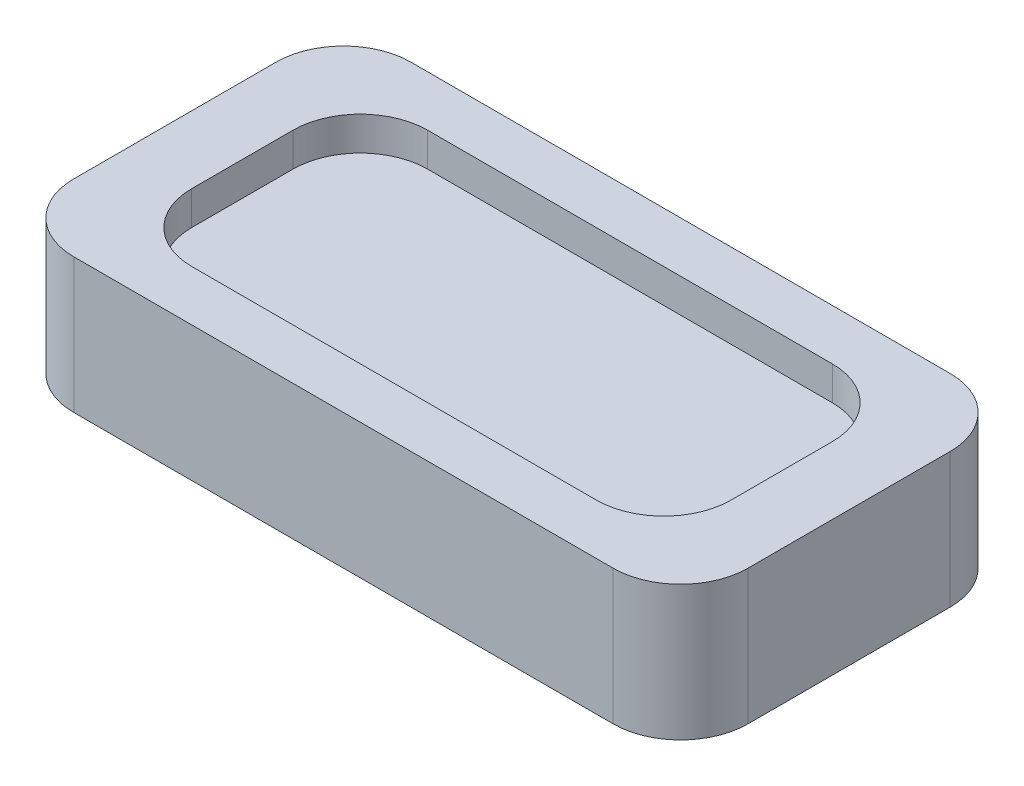
ISO-10303-21;
HEADER;
FILE_DESCRIPTION(('STEP AP214'),'2;1');
FILE_NAME('part.step','',(''),(''),'','','');
FILE_SCHEMA(('AUTOMOTIVE_DESIGN { 1 0 10303 214 1 1 1 1 }'));
ENDSEC;
DATA;
#1=APPLICATION_CONTEXT('core data for automotive mechanical design processes');
#2=APPLICATION_PROTOCOL_DEFINITION('international standard','automotive_design',2000,#1);
#3=PRODUCT_CONTEXT('',#1,'mechanical');
#4=PRODUCT('Part','Part','',(#3));
#5=PRODUCT_RELATED_PRODUCT_CATEGORY('part','',(#4));
#6=PRODUCT_DEFINITION_FORMATION('','',#4);
#7=PRODUCT_DEFINITION_CONTEXT('part definition',#1,'design');
#8=PRODUCT_DEFINITION('design','',#6,#7);
#9=PRODUCT_DEFINITION_SHAPE('','',#8);
#10=(LENGTH_UNIT() NAMED_UNIT(*) SI_UNIT(.MILLI.,.METRE.));
#11=(NAMED_UNIT(*) PLANE_ANGLE_UNIT() SI_UNIT($,.RADIAN.));
#12=(NAMED_UNIT(*) SI_UNIT($,.STERADIAN.) SOLID_ANGLE_UNIT());
#13=UNCERTAINTY_MEASURE_WITH_UNIT(LENGTH_MEASURE(1.E-05),#10,'distance_accuracy_value','');
#14=(GEOMETRIC_REPRESENTATION_CONTEXT(3) GLOBAL_UNCERTAINTY_ASSIGNED_CONTEXT((#13)) GLOBAL_UNIT_ASSIGNED_CONTEXT((#10,
#11,#12)) REPRESENTATION_CONTEXT('',''));
#15=CARTESIAN_POINT('',(0.,0.,0.));
#16=DIRECTION('',(0.,0.,1.));
#17=DIRECTION('',(1.,0.,0.));
#18=AXIS2_PLACEMENT_3D('',#15,#16,#17);
#19=CARTESIAN_POINT('',(-50.,20.,-25.));
#20=DIRECTION('',(1.,0.,0.));
#21=DIRECTION('',(0.,0.,-1.));
#22=AXIS2_PLACEMENT_3D('',#19,#20,#21);
#23=PLANE('',#22);
#24=DIRECTION('',(0.,0.,1.));
#25=VECTOR('',#24,1.);
#26=CARTESIAN_POINT('',(-50.,20.,-25.));
#27=LINE('',#26,#25);
#28=CARTESIAN_POINT('',(-50.,20.,-15.));
#29=VERTEX_POINT('',#28);
#30=CARTESIAN_POINT('',(-50.,20.,15.));
#31=VERTEX_POINT('',#30);
#32=EDGE_CURVE('E176',#29,#31,#27,.T.);
#33=ORIENTED_EDGE('',*,*,#32,.F.);
#34=DIRECTION('',(0.,-1.,0.));
#35=VECTOR('',#34,1.);
#36=CARTESIAN_POINT('',(-50.,0.,-15.));
#37=LINE('',#36,#35);
#38=CARTESIAN_POINT('',(-50.,0.,-15.));
#39=VERTEX_POINT('',#38);
#40=EDGE_CURVE('E160',#29,#39,#37,.T.);
#41=ORIENTED_EDGE('',*,*,#40,.T.);
#42=DIRECTION('',(0.,0.,1.));
#43=VECTOR('',#42,1.);
#44=CARTESIAN_POINT('',(-50.,0.,-25.));
#45=LINE('',#44,#43);
#46=CARTESIAN_POINT('',(-50.,0.,15.));
#47=VERTEX_POINT('',#46);
#48=EDGE_CURVE('E173',#39,#47,#45,.T.);
#49=ORIENTED_EDGE('',*,*,#48,.T.);
#50=DIRECTION('',(0.,-1.,0.));
#51=VECTOR('',#50,1.);
#52=CARTESIAN_POINT('',(-50.,20.,15.));
#53=LINE('',#52,#51);
#54=EDGE_CURVE('E179',#47,#31,#53,.F.);
#55=ORIENTED_EDGE('',*,*,#54,.T.);
#56=EDGE_LOOP('',(#33,#41,#49,#55));
#57=FACE_BOUND('',#56,.T.);
#58=ADVANCED_FACE('F43',(#57),#23,.F.);
#59=CARTESIAN_POINT('',(-50.,20.,25.));
#60=DIRECTION('',(0.,0.,-1.));
#61=DIRECTION('',(-1.,0.,0.));
#62=AXIS2_PLACEMENT_3D('',#59,#60,#61);
#63=PLANE('',#62);
#64=DIRECTION('',(1.,0.,0.));
#65=VECTOR('',#64,1.);
#66=CARTESIAN_POINT('',(-50.,20.,25.));
#67=LINE('',#66,#65);
#68=CARTESIAN_POINT('',(-40.,20.,25.));
#69=VERTEX_POINT('',#68);
#70=CARTESIAN_POINT('',(40.,20.,25.));
#71=VERTEX_POINT('',#70);
#72=EDGE_CURVE('E296',#69,#71,#67,.T.);
#73=ORIENTED_EDGE('',*,*,#72,.F.);
#74=DIRECTION('',(0.,-1.,0.));
#75=VECTOR('',#74,1.);
#76=CARTESIAN_POINT('',(-40.,20.,25.));
#77=LINE('',#76,#75);
#78=CARTESIAN_POINT('',(-40.,0.,25.));
#79=VERTEX_POINT('',#78);
#80=EDGE_CURVE('E234',#69,#79,#77,.T.);
#81=ORIENTED_EDGE('',*,*,#80,.T.);
#82=DIRECTION('',(1.,0.,0.));
#83=VECTOR('',#82,1.);
#84=CARTESIAN_POINT('',(-50.,0.,25.));
#85=LINE('',#84,#83);
#86=CARTESIAN_POINT('',(40.,0.,25.));
#87=VERTEX_POINT('',#86);
#88=EDGE_CURVE('E184',#79,#87,#85,.T.);
#89=ORIENTED_EDGE('',*,*,#88,.T.);
#90=DIRECTION('',(0.,-1.,0.));
#91=VECTOR('',#90,1.);
#92=CARTESIAN_POINT('',(40.,20.,25.));
#93=LINE('',#92,#91);
#94=EDGE_CURVE('E231',#87,#71,#93,.F.);
#95=ORIENTED_EDGE('',*,*,#94,.T.);
#96=EDGE_LOOP('',(#73,#81,#89,#95));
#97=FACE_BOUND('',#96,.T.);
#98=ADVANCED_FACE('F373',(#97),#63,.F.);
#99=CARTESIAN_POINT('',(50.,20.,-25.));
#100=DIRECTION('',(1.,0.,0.));
#101=DIRECTION('',(0.,0.,-1.));
#102=AXIS2_PLACEMENT_3D('',#99,#100,#101);
#103=PLANE('',#102);
#104=DIRECTION('',(0.,0.,1.));
#105=VECTOR('',#104,1.);
#106=CARTESIAN_POINT('',(50.,0.,-25.));
#107=LINE('',#106,#105);
#108=CARTESIAN_POINT('',(50.,0.,-15.));
#109=VERTEX_POINT('',#108);
#110=CARTESIAN_POINT('',(50.,0.,15.));
#111=VERTEX_POINT('',#110);
#112=EDGE_CURVE('E190',#109,#111,#107,.T.);
#113=ORIENTED_EDGE('',*,*,#112,.F.);
#114=DIRECTION('',(0.,-1.,0.));
#115=VECTOR('',#114,1.);
#116=CARTESIAN_POINT('',(50.,20.,-15.));
#117=LINE('',#116,#115);
#118=CARTESIAN_POINT('',(50.,20.,-15.));
#119=VERTEX_POINT('',#118);
#120=EDGE_CURVE('E242',#109,#119,#117,.F.);
#121=ORIENTED_EDGE('',*,*,#120,.T.);
#122=DIRECTION('',(0.,0.,1.));
#123=VECTOR('',#122,1.);
#124=CARTESIAN_POINT('',(50.,20.,-25.));
#125=LINE('',#124,#123);
#126=CARTESIAN_POINT('',(50.,20.,15.));
#127=VERTEX_POINT('',#126);
#128=EDGE_CURVE('E293',#119,#127,#125,.T.);
#129=ORIENTED_EDGE('',*,*,#128,.T.);
#130=DIRECTION('',(0.,-1.,0.));
#131=VECTOR('',#130,1.);
#132=CARTESIAN_POINT('',(50.,0.,15.));
#133=LINE('',#132,#131);
#134=EDGE_CURVE('E238',#127,#111,#133,.T.);
#135=ORIENTED_EDGE('',*,*,#134,.T.);
#136=EDGE_LOOP('',(#113,#121,#129,#135));
#137=FACE_BOUND('',#136,.T.);
#138=ADVANCED_FACE('F378',(#137),#103,.T.);
#139=CARTESIAN_POINT('',(-50.,20.,-25.));
#140=DIRECTION('',(0.,0.,-1.));
#141=DIRECTION('',(-1.,0.,0.));
#142=AXIS2_PLACEMENT_3D('',#139,#140,#141);
#143=PLANE('',#142);
#144=DIRECTION('',(1.,0.,0.));
#145=VECTOR('',#144,1.);
#146=CARTESIAN_POINT('',(-50.,0.,-25.));
#147=LINE('',#146,#145);
#148=CARTESIAN_POINT('',(-40.,0.,-25.));
#149=VERTEX_POINT('',#148);
#150=CARTESIAN_POINT('',(40.,0.,-25.));
#151=VERTEX_POINT('',#150);
#152=EDGE_CURVE('E202',#149,#151,#147,.T.);
#153=ORIENTED_EDGE('',*,*,#152,.F.);
#154=DIRECTION('',(0.,-1.,0.));
#155=VECTOR('',#154,1.);
#156=CARTESIAN_POINT('',(-40.,20.,-25.));
#157=LINE('',#156,#155);
#158=CARTESIAN_POINT('',(-40.,20.,-25.));
#159=VERTEX_POINT('',#158);
#160=EDGE_CURVE('E161',#149,#159,#157,.F.);
#161=ORIENTED_EDGE('',*,*,#160,.T.);
#162=DIRECTION('',(1.,0.,0.));
#163=VECTOR('',#162,1.);
#164=CARTESIAN_POINT('',(-50.,20.,-25.));
#165=LINE('',#164,#163);
#166=CARTESIAN_POINT('',(40.,20.,-25.));
#167=VERTEX_POINT('',#166);
#168=EDGE_CURVE('E196',#159,#167,#165,.T.);
#169=ORIENTED_EDGE('',*,*,#168,.T.);
#170=DIRECTION('',(0.,-1.,0.));
#171=VECTOR('',#170,1.);
#172=CARTESIAN_POINT('',(40.,20.,-25.));
#173=LINE('',#172,#171);
#174=EDGE_CURVE('E167',#167,#151,#173,.T.);
#175=ORIENTED_EDGE('',*,*,#174,.T.);
#176=EDGE_LOOP('',(#153,#161,#169,#175));
#177=FACE_BOUND('',#176,.T.);
#178=ADVANCED_FACE('F476',(#177),#143,.T.);
#179=CARTESIAN_POINT('',(0.,20.,0.));
#180=DIRECTION('',(0.,1.,0.));
#181=DIRECTION('',(0.,0.,1.));
#182=AXIS2_PLACEMENT_3D('',#179,#180,#181);
#183=PLANE('',#182);
#184=DIRECTION('',(0.,0.,1.));
#185=VECTOR('',#184,1.);
#186=CARTESIAN_POINT('',(-40.,20.,-17.5));
#187=LINE('',#186,#185);
#188=CARTESIAN_POINT('',(-40.,20.,-7.5));
#189=VERTEX_POINT('',#188);
#190=CARTESIAN_POINT('',(-40.,20.,7.5));
#191=VERTEX_POINT('',#190);
#192=EDGE_CURVE('E316',#189,#191,#187,.T.);
#193=ORIENTED_EDGE('',*,*,#192,.F.);
#194=CARTESIAN_POINT('',(-30.,20.,-7.5));
#195=DIRECTION('',(0.,1.,0.));
#196=DIRECTION('',(0.,0.,1.));
#197=AXIS2_PLACEMENT_3D('',#194,#195,#196);
#198=CIRCLE('',#197,10.);
#199=CARTESIAN_POINT('',(-30.,20.,-17.5));
#200=VERTEX_POINT('',#199);
#201=EDGE_CURVE('E52',#189,#200,#198,.F.);
#202=ORIENTED_EDGE('',*,*,#201,.T.);
#203=DIRECTION('',(-1.,0.,0.));
#204=VECTOR('',#203,1.);
#205=CARTESIAN_POINT('',(-40.,20.,-17.5));
#206=LINE('',#205,#204);
#207=CARTESIAN_POINT('',(30.,20.,-17.5));
#208=VERTEX_POINT('',#207);
#209=EDGE_CURVE('E304',#208,#200,#206,.T.);
#210=ORIENTED_EDGE('',*,*,#209,.F.);
#211=CARTESIAN_POINT('',(30.,20.,-7.5));
#212=DIRECTION('',(0.,1.,0.));
#213=DIRECTION('',(0.,0.,1.));
#214=AXIS2_PLACEMENT_3D('',#211,#212,#213);
#215=CIRCLE('',#214,10.);
#216=CARTESIAN_POINT('',(40.,20.,-7.5));
#217=VERTEX_POINT('',#216);
#218=EDGE_CURVE('E11',#208,#217,#215,.F.);
#219=ORIENTED_EDGE('',*,*,#218,.T.);
#220=DIRECTION('',(0.,0.,-1.));
#221=VECTOR('',#220,1.);
#222=CARTESIAN_POINT('',(40.,20.,-17.5));
#223=LINE('',#222,#221);
#224=CARTESIAN_POINT('',(40.,20.,7.50000000000001));
#225=VERTEX_POINT('',#224);
#226=EDGE_CURVE('E308',#225,#217,#223,.T.);
#227=ORIENTED_EDGE('',*,*,#226,.F.);
#228=CARTESIAN_POINT('',(30.,20.,7.5));
#229=DIRECTION('',(0.,1.,0.));
#230=DIRECTION('',(0.,0.,1.));
#231=AXIS2_PLACEMENT_3D('',#228,#229,#230);
#232=CIRCLE('',#231,10.);
#233=CARTESIAN_POINT('',(30.,20.,17.5));
#234=VERTEX_POINT('',#233);
#235=EDGE_CURVE('E287',#225,#234,#232,.F.);
#236=ORIENTED_EDGE('',*,*,#235,.T.);
#237=DIRECTION('',(1.,0.,0.));
#238=VECTOR('',#237,1.);
#239=CARTESIAN_POINT('',(-40.,20.,17.5));
#240=LINE('',#239,#238);
#241=CARTESIAN_POINT('',(-30.,20.,17.5));
#242=VERTEX_POINT('',#241);
#243=EDGE_CURVE('E312',#242,#234,#240,.T.);
#244=ORIENTED_EDGE('',*,*,#243,.F.);
#245=CARTESIAN_POINT('',(-30.,20.,7.5));
#246=DIRECTION('',(0.,1.,0.));
#247=DIRECTION('',(0.,0.,1.));
#248=AXIS2_PLACEMENT_3D('',#245,#246,#247);
#249=CIRCLE('',#248,10.);
#250=EDGE_CURVE('E284',#242,#191,#249,.F.);
#251=ORIENTED_EDGE('',*,*,#250,.T.);
#252=EDGE_LOOP('',(#193,#202,#210,#219,#227,#236,#244,#251));
#253=FACE_BOUND('',#252,.T.);
#254=ORIENTED_EDGE('',*,*,#168,.F.);
#255=CARTESIAN_POINT('',(-40.,20.,-15.));
#256=DIRECTION('',(0.,1.,0.));
#257=DIRECTION('',(0.,0.,1.));
#258=AXIS2_PLACEMENT_3D('',#255,#256,#257);
#259=CIRCLE('',#258,10.);
#260=EDGE_CURVE('E228',#159,#29,#259,.T.);
#261=ORIENTED_EDGE('',*,*,#260,.T.);
#262=ORIENTED_EDGE('',*,*,#32,.T.);
#263=CARTESIAN_POINT('',(-40.,20.,15.));
#264=DIRECTION('',(0.,1.,0.));
#265=DIRECTION('',(0.,0.,1.));
#266=AXIS2_PLACEMENT_3D('',#263,#264,#265);
#267=CIRCLE('',#266,10.);
#268=EDGE_CURVE('E225',#31,#69,#267,.T.);
#269=ORIENTED_EDGE('',*,*,#268,.T.);
#270=ORIENTED_EDGE('',*,*,#72,.T.);
#271=CARTESIAN_POINT('',(40.,20.,15.));
#272=DIRECTION('',(0.,1.,0.));
#273=DIRECTION('',(0.,0.,1.));
#274=AXIS2_PLACEMENT_3D('',#271,#272,#273);
#275=CIRCLE('',#274,10.);
#276=EDGE_CURVE('E219',#71,#127,#275,.T.);
#277=ORIENTED_EDGE('',*,*,#276,.T.);
#278=ORIENTED_EDGE('',*,*,#128,.F.);
#279=CARTESIAN_POINT('',(40.,20.,-15.));
#280=DIRECTION('',(0.,1.,0.));
#281=DIRECTION('',(0.,0.,1.));
#282=AXIS2_PLACEMENT_3D('',#279,#280,#281);
#283=CIRCLE('',#282,10.);
#284=EDGE_CURVE('E222',#119,#167,#283,.T.);
#285=ORIENTED_EDGE('',*,*,#284,.T.);
#286=EDGE_LOOP('',(#254,#261,#262,#269,#270,#277,#278,#285));
#287=FACE_BOUND('',#286,.T.);
#288=ADVANCED_FACE('F345',(#253,#287),#183,.T.);
#289=CARTESIAN_POINT('',(0.,0.,0.));
#290=DIRECTION('',(0.,1.,0.));
#291=DIRECTION('',(0.,0.,1.));
#292=AXIS2_PLACEMENT_3D('',#289,#290,#291);
#293=PLANE('',#292);
#294=ORIENTED_EDGE('',*,*,#48,.F.);
#295=CARTESIAN_POINT('',(-40.,0.,-15.));
#296=DIRECTION('',(0.,1.,0.));
#297=DIRECTION('',(0.,0.,1.));
#298=AXIS2_PLACEMENT_3D('',#295,#296,#297);
#299=CIRCLE('',#298,10.);
#300=EDGE_CURVE('E156',#39,#149,#299,.F.);
#301=ORIENTED_EDGE('',*,*,#300,.T.);
#302=ORIENTED_EDGE('',*,*,#152,.T.);
#303=CARTESIAN_POINT('',(40.,0.,-15.));
#304=DIRECTION('',(0.,1.,0.));
#305=DIRECTION('',(0.,0.,1.));
#306=AXIS2_PLACEMENT_3D('',#303,#304,#305);
#307=CIRCLE('',#306,10.);
#308=EDGE_CURVE('E209',#151,#109,#307,.F.);
#309=ORIENTED_EDGE('',*,*,#308,.T.);
#310=ORIENTED_EDGE('',*,*,#112,.T.);
#311=CARTESIAN_POINT('',(40.,0.,15.));
#312=DIRECTION('',(0.,1.,0.));
#313=DIRECTION('',(0.,0.,1.));
#314=AXIS2_PLACEMENT_3D('',#311,#312,#313);
#315=CIRCLE('',#314,10.);
#316=EDGE_CURVE('E178',#111,#87,#315,.F.);
#317=ORIENTED_EDGE('',*,*,#316,.T.);
#318=ORIENTED_EDGE('',*,*,#88,.F.);
#319=CARTESIAN_POINT('',(-40.,0.,15.));
#320=DIRECTION('',(0.,1.,0.));
#321=DIRECTION('',(0.,0.,1.));
#322=AXIS2_PLACEMENT_3D('',#319,#320,#321);
#323=CIRCLE('',#322,10.);
#324=EDGE_CURVE('E168',#79,#47,#323,.F.);
#325=ORIENTED_EDGE('',*,*,#324,.T.);
#326=EDGE_LOOP('',(#294,#301,#302,#309,#310,#317,#318,#325));
#327=FACE_BOUND('',#326,.T.);
#328=ADVANCED_FACE('F181',(#327),#293,.F.);
#329=CARTESIAN_POINT('',(-40.,15.,-17.5));
#330=DIRECTION('',(-1.,0.,0.));
#331=DIRECTION('',(0.,0.,1.));
#332=AXIS2_PLACEMENT_3D('',#329,#330,#331);
#333=PLANE('',#332);
#334=ORIENTED_EDGE('',*,*,#192,.T.);
#335=DIRECTION('',(0.,1.,0.));
#336=VECTOR('',#335,1.);
#337=CARTESIAN_POINT('',(-40.,15.,7.5));
#338=LINE('',#337,#336);
#339=CARTESIAN_POINT('',(-40.,15.,7.5));
#340=VERTEX_POINT('',#339);
#341=EDGE_CURVE('E256',#191,#340,#338,.F.);
#342=ORIENTED_EDGE('',*,*,#341,.T.);
#343=DIRECTION('',(0.,0.,1.));
#344=VECTOR('',#343,1.);
#345=CARTESIAN_POINT('',(-40.,15.,-17.5));
#346=LINE('',#345,#344);
#347=CARTESIAN_POINT('',(-40.,15.,-7.5));
#348=VERTEX_POINT('',#347);
#349=EDGE_CURVE('E307',#348,#340,#346,.T.);
#350=ORIENTED_EDGE('',*,*,#349,.F.);
#351=DIRECTION('',(0.,1.,0.));
#352=VECTOR('',#351,1.);
#353=CARTESIAN_POINT('',(-40.,20.,-7.5));
#354=LINE('',#353,#352);
#355=EDGE_CURVE('E252',#348,#189,#354,.T.);
#356=ORIENTED_EDGE('',*,*,#355,.T.);
#357=EDGE_LOOP('',(#334,#342,#350,#356));
#358=FACE_BOUND('',#357,.T.);
#359=ADVANCED_FACE('F361',(#358),#333,.F.);
#360=CARTESIAN_POINT('',(-40.,15.,-17.5));
#361=DIRECTION('',(0.,0.,-1.));
#362=DIRECTION('',(-1.,0.,0.));
#363=AXIS2_PLACEMENT_3D('',#360,#361,#362);
#364=PLANE('',#363);
#365=ORIENTED_EDGE('',*,*,#209,.T.);
#366=DIRECTION('',(0.,1.,0.));
#367=VECTOR('',#366,1.);
#368=CARTESIAN_POINT('',(-30.,15.,-17.5));
#369=LINE('',#368,#367);
#370=CARTESIAN_POINT('',(-30.,15.,-17.5));
#371=VERTEX_POINT('',#370);
#372=EDGE_CURVE('E281',#200,#371,#369,.F.);
#373=ORIENTED_EDGE('',*,*,#372,.T.);
#374=DIRECTION('',(-1.,0.,0.));
#375=VECTOR('',#374,1.);
#376=CARTESIAN_POINT('',(-40.,15.,-17.5));
#377=LINE('',#376,#375);
#378=CARTESIAN_POINT('',(30.,15.,-17.5));
#379=VERTEX_POINT('',#378);
#380=EDGE_CURVE('E185',#379,#371,#377,.T.);
#381=ORIENTED_EDGE('',*,*,#380,.F.);
#382=DIRECTION('',(0.,1.,0.));
#383=VECTOR('',#382,1.);
#384=CARTESIAN_POINT('',(30.,20.,-17.5));
#385=LINE('',#384,#383);
#386=EDGE_CURVE('E278',#379,#208,#385,.T.);
#387=ORIENTED_EDGE('',*,*,#386,.T.);
#388=EDGE_LOOP('',(#365,#373,#381,#387));
#389=FACE_BOUND('',#388,.T.);
#390=ADVANCED_FACE('F357',(#389),#364,.F.);
#391=CARTESIAN_POINT('',(40.,15.,-17.5));
#392=DIRECTION('',(1.,0.,0.));
#393=DIRECTION('',(0.,0.,-1.));
#394=AXIS2_PLACEMENT_3D('',#391,#392,#393);
#395=PLANE('',#394);
#396=DIRECTION('',(0.,0.,-1.));
#397=VECTOR('',#396,1.);
#398=CARTESIAN_POINT('',(40.,15.,-17.5));
#399=LINE('',#398,#397);
#400=CARTESIAN_POINT('',(40.,15.,7.50000000000001));
#401=VERTEX_POINT('',#400);
#402=CARTESIAN_POINT('',(40.,15.,-7.5));
#403=VERTEX_POINT('',#402);
#404=EDGE_CURVE('E193',#401,#403,#399,.T.);
#405=ORIENTED_EDGE('',*,*,#404,.F.);
#406=DIRECTION('',(0.,1.,0.));
#407=VECTOR('',#406,1.);
#408=CARTESIAN_POINT('',(40.,20.,7.50000000000001));
#409=LINE('',#408,#407);
#410=EDGE_CURVE('E274',#401,#225,#409,.T.);
#411=ORIENTED_EDGE('',*,*,#410,.T.);
#412=ORIENTED_EDGE('',*,*,#226,.T.);
#413=DIRECTION('',(0.,1.,0.));
#414=VECTOR('',#413,1.);
#415=CARTESIAN_POINT('',(40.,15.,-7.5));
#416=LINE('',#415,#414);
#417=EDGE_CURVE('E271',#217,#403,#416,.F.);
#418=ORIENTED_EDGE('',*,*,#417,.T.);
#419=EDGE_LOOP('',(#405,#411,#412,#418));
#420=FACE_BOUND('',#419,.T.);
#421=ADVANCED_FACE('F353',(#420),#395,.F.);
#422=CARTESIAN_POINT('',(-40.,15.,17.5));
#423=DIRECTION('',(0.,0.,1.));
#424=DIRECTION('',(1.,0.,0.));
#425=AXIS2_PLACEMENT_3D('',#422,#423,#424);
#426=PLANE('',#425);
#427=DIRECTION('',(1.,0.,0.));
#428=VECTOR('',#427,1.);
#429=CARTESIAN_POINT('',(-40.,15.,17.5));
#430=LINE('',#429,#428);
#431=CARTESIAN_POINT('',(-30.,15.,17.5));
#432=VERTEX_POINT('',#431);
#433=CARTESIAN_POINT('',(30.,15.,17.5));
#434=VERTEX_POINT('',#433);
#435=EDGE_CURVE('E323',#432,#434,#430,.T.);
#436=ORIENTED_EDGE('',*,*,#435,.F.);
#437=DIRECTION('',(0.,1.,0.));
#438=VECTOR('',#437,1.);
#439=CARTESIAN_POINT('',(-30.,20.,17.5));
#440=LINE('',#439,#438);
#441=EDGE_CURVE('E248',#432,#242,#440,.T.);
#442=ORIENTED_EDGE('',*,*,#441,.T.);
#443=ORIENTED_EDGE('',*,*,#243,.T.);
#444=DIRECTION('',(0.,1.,0.));
#445=VECTOR('',#444,1.);
#446=CARTESIAN_POINT('',(30.,15.,17.5));
#447=LINE('',#446,#445);
#448=EDGE_CURVE('E245',#234,#434,#447,.F.);
#449=ORIENTED_EDGE('',*,*,#448,.T.);
#450=EDGE_LOOP('',(#436,#442,#443,#449));
#451=FACE_BOUND('',#450,.T.);
#452=ADVANCED_FACE('F343',(#451),#426,.F.);
#453=CARTESIAN_POINT('',(0.,15.,0.));
#454=DIRECTION('',(0.,1.,0.));
#455=DIRECTION('',(0.,0.,1.));
#456=AXIS2_PLACEMENT_3D('',#453,#454,#455);
#457=PLANE('',#456);
#458=ORIENTED_EDGE('',*,*,#349,.T.);
#459=CARTESIAN_POINT('',(-30.,15.,7.5));
#460=DIRECTION('',(0.,1.,0.));
#461=DIRECTION('',(0.,0.,1.));
#462=AXIS2_PLACEMENT_3D('',#459,#460,#461);
#463=CIRCLE('',#462,10.);
#464=EDGE_CURVE('E268',#340,#432,#463,.T.);
#465=ORIENTED_EDGE('',*,*,#464,.T.);
#466=ORIENTED_EDGE('',*,*,#435,.T.);
#467=CARTESIAN_POINT('',(30.,15.,7.5));
#468=DIRECTION('',(0.,1.,0.));
#469=DIRECTION('',(0.,0.,1.));
#470=AXIS2_PLACEMENT_3D('',#467,#468,#469);
#471=CIRCLE('',#470,10.);
#472=EDGE_CURVE('E265',#434,#401,#471,.T.);
#473=ORIENTED_EDGE('',*,*,#472,.T.);
#474=ORIENTED_EDGE('',*,*,#404,.T.);
#475=CARTESIAN_POINT('',(30.,15.,-7.5));
#476=DIRECTION('',(0.,1.,0.));
#477=DIRECTION('',(0.,0.,1.));
#478=AXIS2_PLACEMENT_3D('',#475,#476,#477);
#479=CIRCLE('',#478,10.);
#480=EDGE_CURVE('E259',#403,#379,#479,.T.);
#481=ORIENTED_EDGE('',*,*,#480,.T.);
#482=ORIENTED_EDGE('',*,*,#380,.T.);
#483=CARTESIAN_POINT('',(-30.,15.,-7.5));
#484=DIRECTION('',(0.,1.,0.));
#485=DIRECTION('',(0.,0.,1.));
#486=AXIS2_PLACEMENT_3D('',#483,#484,#485);
#487=CIRCLE('',#486,10.);
#488=EDGE_CURVE('E262',#371,#348,#487,.T.);
#489=ORIENTED_EDGE('',*,*,#488,.T.);
#490=EDGE_LOOP('',(#458,#465,#466,#473,#474,#481,#482,#489));
#491=FACE_BOUND('',#490,.T.);
#492=ADVANCED_FACE('F332',(#491),#457,.T.);
#493=CARTESIAN_POINT('',(-40.,20.,-15.));
#494=DIRECTION('',(0.,1.,0.));
#495=DIRECTION('',(0.,0.,1.));
#496=AXIS2_PLACEMENT_3D('',#493,#494,#495);
#497=CYLINDRICAL_SURFACE('',#496,10.);
#498=ORIENTED_EDGE('',*,*,#260,.F.);
#499=ORIENTED_EDGE('',*,*,#160,.F.);
#500=ORIENTED_EDGE('',*,*,#300,.F.);
#501=ORIENTED_EDGE('',*,*,#40,.F.);
#502=EDGE_LOOP('',(#498,#499,#500,#501));
#503=FACE_BOUND('',#502,.T.);
#504=ADVANCED_FACE('F159',(#503),#497,.T.);
#505=CARTESIAN_POINT('',(-40.,20.,15.));
#506=DIRECTION('',(0.,-1.,0.));
#507=DIRECTION('',(0.,0.,-1.));
#508=AXIS2_PLACEMENT_3D('',#505,#506,#507);
#509=CYLINDRICAL_SURFACE('',#508,10.);
#510=ORIENTED_EDGE('',*,*,#268,.F.);
#511=ORIENTED_EDGE('',*,*,#54,.F.);
#512=ORIENTED_EDGE('',*,*,#324,.F.);
#513=ORIENTED_EDGE('',*,*,#80,.F.);
#514=EDGE_LOOP('',(#510,#511,#512,#513));
#515=FACE_BOUND('',#514,.T.);
#516=ADVANCED_FACE('F385',(#515),#509,.T.);
#517=CARTESIAN_POINT('',(40.,20.,-15.));
#518=DIRECTION('',(0.,-1.,0.));
#519=DIRECTION('',(0.,0.,-1.));
#520=AXIS2_PLACEMENT_3D('',#517,#518,#519);
#521=CYLINDRICAL_SURFACE('',#520,10.);
#522=ORIENTED_EDGE('',*,*,#284,.F.);
#523=ORIENTED_EDGE('',*,*,#120,.F.);
#524=ORIENTED_EDGE('',*,*,#308,.F.);
#525=ORIENTED_EDGE('',*,*,#174,.F.);
#526=EDGE_LOOP('',(#522,#523,#524,#525));
#527=FACE_BOUND('',#526,.T.);
#528=ADVANCED_FACE('F388',(#527),#521,.T.);
#529=CARTESIAN_POINT('',(40.,20.,15.));
#530=DIRECTION('',(0.,1.,0.));
#531=DIRECTION('',(0.,0.,1.));
#532=AXIS2_PLACEMENT_3D('',#529,#530,#531);
#533=CYLINDRICAL_SURFACE('',#532,10.);
#534=ORIENTED_EDGE('',*,*,#276,.F.);
#535=ORIENTED_EDGE('',*,*,#94,.F.);
#536=ORIENTED_EDGE('',*,*,#316,.F.);
#537=ORIENTED_EDGE('',*,*,#134,.F.);
#538=EDGE_LOOP('',(#534,#535,#536,#537));
#539=FACE_BOUND('',#538,.T.);
#540=ADVANCED_FACE('F392',(#539),#533,.T.);
#541=CARTESIAN_POINT('',(-30.,15.,7.5));
#542=DIRECTION('',(0.,-1.,0.));
#543=DIRECTION('',(0.,0.,-1.));
#544=AXIS2_PLACEMENT_3D('',#541,#542,#543);
#545=CYLINDRICAL_SURFACE('',#544,10.);
#546=ORIENTED_EDGE('',*,*,#464,.F.);
#547=ORIENTED_EDGE('',*,*,#341,.F.);
#548=ORIENTED_EDGE('',*,*,#250,.F.);
#549=ORIENTED_EDGE('',*,*,#441,.F.);
#550=EDGE_LOOP('',(#546,#547,#548,#549));
#551=FACE_BOUND('',#550,.T.);
#552=ADVANCED_FACE('F340',(#551),#545,.F.);
#553=CARTESIAN_POINT('',(30.,15.,7.5));
#554=DIRECTION('',(0.,-1.,0.));
#555=DIRECTION('',(0.,0.,-1.));
#556=AXIS2_PLACEMENT_3D('',#553,#554,#555);
#557=CYLINDRICAL_SURFACE('',#556,10.);
#558=ORIENTED_EDGE('',*,*,#472,.F.);
#559=ORIENTED_EDGE('',*,*,#448,.F.);
#560=ORIENTED_EDGE('',*,*,#235,.F.);
#561=ORIENTED_EDGE('',*,*,#410,.F.);
#562=EDGE_LOOP('',(#558,#559,#560,#561));
#563=FACE_BOUND('',#562,.T.);
#564=ADVANCED_FACE('F350',(#563),#557,.F.);
#565=CARTESIAN_POINT('',(-30.,15.,-7.5));
#566=DIRECTION('',(0.,-1.,0.));
#567=DIRECTION('',(0.,0.,-1.));
#568=AXIS2_PLACEMENT_3D('',#565,#566,#567);
#569=CYLINDRICAL_SURFACE('',#568,10.);
#570=ORIENTED_EDGE('',*,*,#488,.F.);
#571=ORIENTED_EDGE('',*,*,#372,.F.);
#572=ORIENTED_EDGE('',*,*,#201,.F.);
#573=ORIENTED_EDGE('',*,*,#355,.F.);
#574=EDGE_LOOP('',(#570,#571,#572,#573));
#575=FACE_BOUND('',#574,.T.);
#576=ADVANCED_FACE('F360',(#575),#569,.F.);
#577=CARTESIAN_POINT('',(30.,15.,-7.5));
#578=DIRECTION('',(0.,-1.,0.));
#579=DIRECTION('',(0.,0.,-1.));
#580=AXIS2_PLACEMENT_3D('',#577,#578,#579);
#581=CYLINDRICAL_SURFACE('',#580,10.);
#582=ORIENTED_EDGE('',*,*,#480,.F.);
#583=ORIENTED_EDGE('',*,*,#417,.F.);
#584=ORIENTED_EDGE('',*,*,#218,.F.);
#585=ORIENTED_EDGE('',*,*,#386,.F.);
#586=EDGE_LOOP('',(#582,#583,#584,#585));
#587=FACE_BOUND('',#586,.T.);
#588=ADVANCED_FACE('F45',(#587),#581,.F.);
#589=CLOSED_SHELL('',(#58,#98,#138,#178,#288,#328,#359,#390,#421,#452,#492,#504,#516,#528,#540,
#552,#564,#576,#588));
#590=MANIFOLD_SOLID_BREP('B2',#589);
#591=ADVANCED_BREP_SHAPE_REPRESENTATION('',(#18,#590),#14);
#592=SHAPE_DEFINITION_REPRESENTATION(#9,#591);
ENDSEC;
END-ISO-10303-21;
